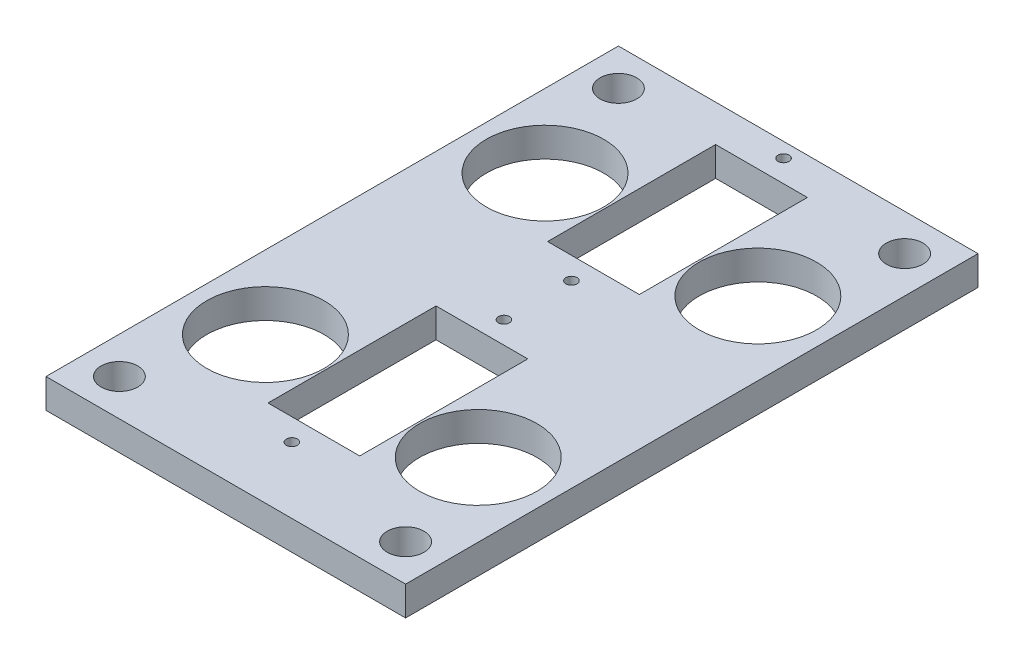
ISO-10303-21;
HEADER;
FILE_DESCRIPTION(('STEP AP214'),'2;1');
FILE_NAME('part.step','',(''),(''),'','','');
FILE_SCHEMA(('AUTOMOTIVE_DESIGN { 1 0 10303 214 1 1 1 1 }'));
ENDSEC;
DATA;
#1=APPLICATION_CONTEXT('core data for automotive mechanical design processes');
#2=APPLICATION_PROTOCOL_DEFINITION('international standard','automotive_design',2000,#1);
#3=PRODUCT_CONTEXT('',#1,'mechanical');
#4=PRODUCT('Part','Part','',(#3));
#5=PRODUCT_RELATED_PRODUCT_CATEGORY('part','',(#4));
#6=PRODUCT_DEFINITION_FORMATION('','',#4);
#7=PRODUCT_DEFINITION_CONTEXT('part definition',#1,'design');
#8=PRODUCT_DEFINITION('design','',#6,#7);
#9=PRODUCT_DEFINITION_SHAPE('','',#8);
#10=(LENGTH_UNIT() NAMED_UNIT(*) SI_UNIT(.MILLI.,.METRE.));
#11=(NAMED_UNIT(*) PLANE_ANGLE_UNIT() SI_UNIT($,.RADIAN.));
#12=(NAMED_UNIT(*) SI_UNIT($,.STERADIAN.) SOLID_ANGLE_UNIT());
#13=UNCERTAINTY_MEASURE_WITH_UNIT(LENGTH_MEASURE(1.E-05),#10,'distance_accuracy_value','');
#14=(GEOMETRIC_REPRESENTATION_CONTEXT(3) GLOBAL_UNCERTAINTY_ASSIGNED_CONTEXT((#13)) GLOBAL_UNIT_ASSIGNED_CONTEXT((#10,
#11,#12)) REPRESENTATION_CONTEXT('',''));
#15=CARTESIAN_POINT('',(0.,0.,0.));
#16=DIRECTION('',(0.,0.,1.));
#17=DIRECTION('',(1.,0.,0.));
#18=AXIS2_PLACEMENT_3D('',#15,#16,#17);
#19=CARTESIAN_POINT('',(0.,4.,0.));
#20=DIRECTION('',(0.,1.,0.));
#21=DIRECTION('',(0.,0.,1.));
#22=AXIS2_PLACEMENT_3D('',#19,#20,#21);
#23=PLANE('',#22);
#24=CARTESIAN_POINT('',(-19.5,4.,36.));
#25=DIRECTION('',(0.,1.,0.));
#26=DIRECTION('',(0.,0.,1.));
#27=AXIS2_PLACEMENT_3D('',#24,#25,#26);
#28=CIRCLE('',#27,2.5);
#29=CARTESIAN_POINT('',(-19.5,4.,38.5));
#30=VERTEX_POINT('',#29);
#31=EDGE_CURVE('E289',#30,#30,#28,.T.);
#32=ORIENTED_EDGE('',*,*,#31,.F.);
#33=EDGE_LOOP('',(#32));
#34=FACE_BOUND('',#33,.T.);
#35=CARTESIAN_POINT('',(19.5,4.,36.));
#36=DIRECTION('',(0.,1.,0.));
#37=DIRECTION('',(0.,0.,1.));
#38=AXIS2_PLACEMENT_3D('',#35,#36,#37);
#39=CIRCLE('',#38,2.5);
#40=CARTESIAN_POINT('',(19.5,4.,38.5));
#41=VERTEX_POINT('',#40);
#42=EDGE_CURVE('E158',#41,#41,#39,.T.);
#43=ORIENTED_EDGE('',*,*,#42,.F.);
#44=EDGE_LOOP('',(#43));
#45=FACE_BOUND('',#44,.T.);
#46=CARTESIAN_POINT('',(0.,4.,-35.));
#47=DIRECTION('',(0.,1.,0.));
#48=DIRECTION('',(0.,0.,1.));
#49=AXIS2_PLACEMENT_3D('',#46,#47,#48);
#50=CIRCLE('',#49,0.75);
#51=CARTESIAN_POINT('',(0.,4.,-34.25));
#52=VERTEX_POINT('',#51);
#53=EDGE_CURVE('E168',#52,#52,#50,.T.);
#54=ORIENTED_EDGE('',*,*,#53,.F.);
#55=EDGE_LOOP('',(#54));
#56=FACE_BOUND('',#55,.T.);
#57=CARTESIAN_POINT('',(0.,4.,-6.09999999999998));
#58=DIRECTION('',(0.,1.,0.));
#59=DIRECTION('',(0.,0.,1.));
#60=AXIS2_PLACEMENT_3D('',#57,#58,#59);
#61=CIRCLE('',#60,0.75);
#62=CARTESIAN_POINT('',(0.,4.,-5.34999999999998));
#63=VERTEX_POINT('',#62);
#64=EDGE_CURVE('E174',#63,#63,#61,.T.);
#65=ORIENTED_EDGE('',*,*,#64,.F.);
#66=EDGE_LOOP('',(#65));
#67=FACE_BOUND('',#66,.T.);
#68=CARTESIAN_POINT('',(0.,4.,3.10000000000001));
#69=DIRECTION('',(0.,1.,0.));
#70=DIRECTION('',(0.,0.,1.));
#71=AXIS2_PLACEMENT_3D('',#68,#69,#70);
#72=CIRCLE('',#71,0.75);
#73=CARTESIAN_POINT('',(0.,4.,3.85000000000001));
#74=VERTEX_POINT('',#73);
#75=EDGE_CURVE('E180',#74,#74,#72,.T.);
#76=ORIENTED_EDGE('',*,*,#75,.F.);
#77=EDGE_LOOP('',(#76));
#78=FACE_BOUND('',#77,.T.);
#79=CARTESIAN_POINT('',(0.,4.,32.));
#80=DIRECTION('',(0.,1.,0.));
#81=DIRECTION('',(0.,0.,1.));
#82=AXIS2_PLACEMENT_3D('',#79,#80,#81);
#83=CIRCLE('',#82,0.75);
#84=CARTESIAN_POINT('',(0.,4.,32.75));
#85=VERTEX_POINT('',#84);
#86=EDGE_CURVE('E163',#85,#85,#83,.T.);
#87=ORIENTED_EDGE('',*,*,#86,.F.);
#88=EDGE_LOOP('',(#87));
#89=FACE_BOUND('',#88,.T.);
#90=CARTESIAN_POINT('',(-19.5,4.,-32.));
#91=DIRECTION('',(0.,1.,0.));
#92=DIRECTION('',(0.,0.,1.));
#93=AXIS2_PLACEMENT_3D('',#90,#91,#92);
#94=CIRCLE('',#93,2.5);
#95=CARTESIAN_POINT('',(-19.5,4.,-29.5));
#96=VERTEX_POINT('',#95);
#97=EDGE_CURVE('E194',#96,#96,#94,.T.);
#98=ORIENTED_EDGE('',*,*,#97,.F.);
#99=EDGE_LOOP('',(#98));
#100=FACE_BOUND('',#99,.T.);
#101=CARTESIAN_POINT('',(-14.5,4.,-17.));
#102=DIRECTION('',(0.,1.,0.));
#103=DIRECTION('',(0.,0.,1.));
#104=AXIS2_PLACEMENT_3D('',#101,#102,#103);
#105=CIRCLE('',#104,8.);
#106=CARTESIAN_POINT('',(-14.5,4.,-8.99999999999998));
#107=VERTEX_POINT('',#106);
#108=EDGE_CURVE('E206',#107,#107,#105,.T.);
#109=ORIENTED_EDGE('',*,*,#108,.F.);
#110=EDGE_LOOP('',(#109));
#111=FACE_BOUND('',#110,.T.);
#112=DIRECTION('',(-1.,0.,0.));
#113=VECTOR('',#112,1.);
#114=CARTESIAN_POINT('',(-6.25,4.,6.10000000000001));
#115=LINE('',#114,#113);
#116=CARTESIAN_POINT('',(6.25,4.,6.10000000000001));
#117=VERTEX_POINT('',#116);
#118=CARTESIAN_POINT('',(-6.25,4.,6.10000000000001));
#119=VERTEX_POINT('',#118);
#120=EDGE_CURVE('E245',#117,#119,#115,.T.);
#121=ORIENTED_EDGE('',*,*,#120,.F.);
#122=DIRECTION('',(0.,0.,-1.));
#123=VECTOR('',#122,1.);
#124=CARTESIAN_POINT('',(6.25,4.,6.10000000000001));
#125=LINE('',#124,#123);
#126=CARTESIAN_POINT('',(6.25,4.,29.));
#127=VERTEX_POINT('',#126);
#128=EDGE_CURVE('E243',#127,#117,#125,.T.);
#129=ORIENTED_EDGE('',*,*,#128,.F.);
#130=DIRECTION('',(1.,0.,0.));
#131=VECTOR('',#130,1.);
#132=CARTESIAN_POINT('',(-6.25,4.,29.));
#133=LINE('',#132,#131);
#134=CARTESIAN_POINT('',(-6.25,4.,29.));
#135=VERTEX_POINT('',#134);
#136=EDGE_CURVE('E251',#135,#127,#133,.T.);
#137=ORIENTED_EDGE('',*,*,#136,.F.);
#138=DIRECTION('',(0.,0.,1.));
#139=VECTOR('',#138,1.);
#140=CARTESIAN_POINT('',(-6.25,4.,6.10000000000001));
#141=LINE('',#140,#139);
#142=EDGE_CURVE('E248',#119,#135,#141,.T.);
#143=ORIENTED_EDGE('',*,*,#142,.F.);
#144=EDGE_LOOP('',(#121,#129,#137,#143));
#145=FACE_BOUND('',#144,.T.);
#146=CARTESIAN_POINT('',(14.5,4.,21.1));
#147=DIRECTION('',(0.,1.,0.));
#148=DIRECTION('',(0.,0.,1.));
#149=AXIS2_PLACEMENT_3D('',#146,#147,#148);
#150=CIRCLE('',#149,8.);
#151=CARTESIAN_POINT('',(14.5,4.,29.1));
#152=VERTEX_POINT('',#151);
#153=EDGE_CURVE('E274',#152,#152,#150,.T.);
#154=ORIENTED_EDGE('',*,*,#153,.F.);
#155=EDGE_LOOP('',(#154));
#156=FACE_BOUND('',#155,.T.);
#157=DIRECTION('',(0.,0.,-1.));
#158=VECTOR('',#157,1.);
#159=CARTESIAN_POINT('',(24.5,4.,-37.));
#160=LINE('',#159,#158);
#161=CARTESIAN_POINT('',(24.5,4.,41.));
#162=VERTEX_POINT('',#161);
#163=CARTESIAN_POINT('',(24.5,4.,-37.));
#164=VERTEX_POINT('',#163);
#165=EDGE_CURVE('E280',#162,#164,#160,.T.);
#166=ORIENTED_EDGE('',*,*,#165,.T.);
#167=DIRECTION('',(-1.,0.,0.));
#168=VECTOR('',#167,1.);
#169=CARTESIAN_POINT('',(-24.5,4.,-37.));
#170=LINE('',#169,#168);
#171=CARTESIAN_POINT('',(-24.5,4.,-37.));
#172=VERTEX_POINT('',#171);
#173=EDGE_CURVE('E135',#164,#172,#170,.T.);
#174=ORIENTED_EDGE('',*,*,#173,.T.);
#175=DIRECTION('',(0.,0.,1.));
#176=VECTOR('',#175,1.);
#177=CARTESIAN_POINT('',(-24.5,4.,-37.));
#178=LINE('',#177,#176);
#179=CARTESIAN_POINT('',(-24.5,4.,41.));
#180=VERTEX_POINT('',#179);
#181=EDGE_CURVE('E129',#172,#180,#178,.T.);
#182=ORIENTED_EDGE('',*,*,#181,.T.);
#183=DIRECTION('',(1.,0.,0.));
#184=VECTOR('',#183,1.);
#185=CARTESIAN_POINT('',(-24.5,4.,41.));
#186=LINE('',#185,#184);
#187=EDGE_CURVE('E134',#180,#162,#186,.T.);
#188=ORIENTED_EDGE('',*,*,#187,.T.);
#189=EDGE_LOOP('',(#166,#174,#182,#188));
#190=FACE_BOUND('',#189,.T.);
#191=CARTESIAN_POINT('',(-14.5,4.,21.1));
#192=DIRECTION('',(0.,1.,0.));
#193=DIRECTION('',(0.,0.,1.));
#194=AXIS2_PLACEMENT_3D('',#191,#192,#193);
#195=CIRCLE('',#194,8.);
#196=CARTESIAN_POINT('',(-14.5,4.,29.1));
#197=VERTEX_POINT('',#196);
#198=EDGE_CURVE('E237',#197,#197,#195,.T.);
#199=ORIENTED_EDGE('',*,*,#198,.F.);
#200=EDGE_LOOP('',(#199));
#201=FACE_BOUND('',#200,.T.);
#202=DIRECTION('',(1.,0.,0.));
#203=VECTOR('',#202,1.);
#204=CARTESIAN_POINT('',(6.25,4.,-9.09999999999998));
#205=LINE('',#204,#203);
#206=CARTESIAN_POINT('',(-6.25,4.,-9.09999999999998));
#207=VERTEX_POINT('',#206);
#208=CARTESIAN_POINT('',(6.25,4.,-9.09999999999998));
#209=VERTEX_POINT('',#208);
#210=EDGE_CURVE('E213',#207,#209,#205,.T.);
#211=ORIENTED_EDGE('',*,*,#210,.F.);
#212=DIRECTION('',(0.,0.,1.));
#213=VECTOR('',#212,1.);
#214=CARTESIAN_POINT('',(-6.25000000000001,4.,-32.));
#215=LINE('',#214,#213);
#216=CARTESIAN_POINT('',(-6.25000000000001,4.,-32.));
#217=VERTEX_POINT('',#216);
#218=EDGE_CURVE('E211',#217,#207,#215,.T.);
#219=ORIENTED_EDGE('',*,*,#218,.F.);
#220=DIRECTION('',(-1.,0.,0.));
#221=VECTOR('',#220,1.);
#222=CARTESIAN_POINT('',(6.24999999999999,4.,-32.));
#223=LINE('',#222,#221);
#224=CARTESIAN_POINT('',(6.24999999999999,4.,-32.));
#225=VERTEX_POINT('',#224);
#226=EDGE_CURVE('E218',#225,#217,#223,.T.);
#227=ORIENTED_EDGE('',*,*,#226,.F.);
#228=DIRECTION('',(0.,0.,-1.));
#229=VECTOR('',#228,1.);
#230=CARTESIAN_POINT('',(6.24999999999999,4.,-32.));
#231=LINE('',#230,#229);
#232=EDGE_CURVE('E216',#209,#225,#231,.T.);
#233=ORIENTED_EDGE('',*,*,#232,.F.);
#234=EDGE_LOOP('',(#211,#219,#227,#233));
#235=FACE_BOUND('',#234,.T.);
#236=CARTESIAN_POINT('',(14.5,4.,-17.));
#237=DIRECTION('',(0.,1.,0.));
#238=DIRECTION('',(0.,0.,1.));
#239=AXIS2_PLACEMENT_3D('',#236,#237,#238);
#240=CIRCLE('',#239,8.);
#241=CARTESIAN_POINT('',(14.5,4.,-8.99999999999998));
#242=VERTEX_POINT('',#241);
#243=EDGE_CURVE('E200',#242,#242,#240,.T.);
#244=ORIENTED_EDGE('',*,*,#243,.F.);
#245=EDGE_LOOP('',(#244));
#246=FACE_BOUND('',#245,.T.);
#247=CARTESIAN_POINT('',(19.5,4.,-32.));
#248=DIRECTION('',(0.,1.,0.));
#249=DIRECTION('',(0.,0.,1.));
#250=AXIS2_PLACEMENT_3D('',#247,#248,#249);
#251=CIRCLE('',#250,2.5);
#252=CARTESIAN_POINT('',(19.5,4.,-29.5));
#253=VERTEX_POINT('',#252);
#254=EDGE_CURVE('E188',#253,#253,#251,.T.);
#255=ORIENTED_EDGE('',*,*,#254,.F.);
#256=EDGE_LOOP('',(#255));
#257=FACE_BOUND('',#256,.T.);
#258=ADVANCED_FACE('F36',(#34,#45,#56,#67,#78,#89,#100,#111,#145,#156,#190,#201,#235,#246,#257),
#23,.T.);
#259=CARTESIAN_POINT('',(0.,0.,0.));
#260=DIRECTION('',(0.,1.,0.));
#261=DIRECTION('',(0.,0.,1.));
#262=AXIS2_PLACEMENT_3D('',#259,#260,#261);
#263=PLANE('',#262);
#264=CARTESIAN_POINT('',(-19.5,0.,36.));
#265=DIRECTION('',(0.,1.,0.));
#266=DIRECTION('',(0.,0.,1.));
#267=AXIS2_PLACEMENT_3D('',#264,#265,#266);
#268=CIRCLE('',#267,2.5);
#269=CARTESIAN_POINT('',(-19.5,0.,38.5));
#270=VERTEX_POINT('',#269);
#271=EDGE_CURVE('E40',#270,#270,#268,.T.);
#272=ORIENTED_EDGE('',*,*,#271,.T.);
#273=EDGE_LOOP('',(#272));
#274=FACE_BOUND('',#273,.T.);
#275=CARTESIAN_POINT('',(19.5,0.,36.));
#276=DIRECTION('',(0.,1.,0.));
#277=DIRECTION('',(0.,0.,1.));
#278=AXIS2_PLACEMENT_3D('',#275,#276,#277);
#279=CIRCLE('',#278,2.5);
#280=CARTESIAN_POINT('',(19.5,0.,38.5));
#281=VERTEX_POINT('',#280);
#282=EDGE_CURVE('E155',#281,#281,#279,.T.);
#283=ORIENTED_EDGE('',*,*,#282,.T.);
#284=EDGE_LOOP('',(#283));
#285=FACE_BOUND('',#284,.T.);
#286=CARTESIAN_POINT('',(0.,0.,-35.));
#287=DIRECTION('',(0.,1.,0.));
#288=DIRECTION('',(0.,0.,1.));
#289=AXIS2_PLACEMENT_3D('',#286,#287,#288);
#290=CIRCLE('',#289,0.75);
#291=CARTESIAN_POINT('',(0.,0.,-34.25));
#292=VERTEX_POINT('',#291);
#293=EDGE_CURVE('E164',#292,#292,#290,.T.);
#294=ORIENTED_EDGE('',*,*,#293,.T.);
#295=EDGE_LOOP('',(#294));
#296=FACE_BOUND('',#295,.T.);
#297=CARTESIAN_POINT('',(0.,0.,-6.09999999999998));
#298=DIRECTION('',(0.,1.,0.));
#299=DIRECTION('',(0.,0.,1.));
#300=AXIS2_PLACEMENT_3D('',#297,#298,#299);
#301=CIRCLE('',#300,0.75);
#302=CARTESIAN_POINT('',(0.,0.,-5.34999999999998));
#303=VERTEX_POINT('',#302);
#304=EDGE_CURVE('E171',#303,#303,#301,.T.);
#305=ORIENTED_EDGE('',*,*,#304,.T.);
#306=EDGE_LOOP('',(#305));
#307=FACE_BOUND('',#306,.T.);
#308=CARTESIAN_POINT('',(0.,0.,3.10000000000001));
#309=DIRECTION('',(0.,1.,0.));
#310=DIRECTION('',(0.,0.,1.));
#311=AXIS2_PLACEMENT_3D('',#308,#309,#310);
#312=CIRCLE('',#311,0.75);
#313=CARTESIAN_POINT('',(0.,0.,3.85000000000001));
#314=VERTEX_POINT('',#313);
#315=EDGE_CURVE('E177',#314,#314,#312,.T.);
#316=ORIENTED_EDGE('',*,*,#315,.T.);
#317=EDGE_LOOP('',(#316));
#318=FACE_BOUND('',#317,.T.);
#319=CARTESIAN_POINT('',(0.,0.,32.));
#320=DIRECTION('',(0.,1.,0.));
#321=DIRECTION('',(0.,0.,1.));
#322=AXIS2_PLACEMENT_3D('',#319,#320,#321);
#323=CIRCLE('',#322,0.75);
#324=CARTESIAN_POINT('',(0.,0.,32.75));
#325=VERTEX_POINT('',#324);
#326=EDGE_CURVE('E183',#325,#325,#323,.T.);
#327=ORIENTED_EDGE('',*,*,#326,.T.);
#328=EDGE_LOOP('',(#327));
#329=FACE_BOUND('',#328,.T.);
#330=CARTESIAN_POINT('',(-14.5,0.,21.1));
#331=DIRECTION('',(0.,1.,0.));
#332=DIRECTION('',(0.,0.,1.));
#333=AXIS2_PLACEMENT_3D('',#330,#331,#332);
#334=CIRCLE('',#333,8.);
#335=CARTESIAN_POINT('',(-14.5,0.,29.1));
#336=VERTEX_POINT('',#335);
#337=EDGE_CURVE('E236',#336,#336,#334,.T.);
#338=ORIENTED_EDGE('',*,*,#337,.T.);
#339=EDGE_LOOP('',(#338));
#340=FACE_BOUND('',#339,.T.);
#341=DIRECTION('',(0.,0.,-1.));
#342=VECTOR('',#341,1.);
#343=CARTESIAN_POINT('',(6.25,0.,6.10000000000001));
#344=LINE('',#343,#342);
#345=CARTESIAN_POINT('',(6.25,0.,29.));
#346=VERTEX_POINT('',#345);
#347=CARTESIAN_POINT('',(6.25,0.,6.10000000000001));
#348=VERTEX_POINT('',#347);
#349=EDGE_CURVE('E240',#346,#348,#344,.T.);
#350=ORIENTED_EDGE('',*,*,#349,.T.);
#351=DIRECTION('',(-1.,0.,0.));
#352=VECTOR('',#351,1.);
#353=CARTESIAN_POINT('',(-6.25,0.,6.10000000000001));
#354=LINE('',#353,#352);
#355=CARTESIAN_POINT('',(-6.25,0.,6.10000000000001));
#356=VERTEX_POINT('',#355);
#357=EDGE_CURVE('E256',#348,#356,#354,.T.);
#358=ORIENTED_EDGE('',*,*,#357,.T.);
#359=DIRECTION('',(0.,0.,1.));
#360=VECTOR('',#359,1.);
#361=CARTESIAN_POINT('',(-6.25,0.,6.10000000000001));
#362=LINE('',#361,#360);
#363=CARTESIAN_POINT('',(-6.25,0.,29.));
#364=VERTEX_POINT('',#363);
#365=EDGE_CURVE('E259',#356,#364,#362,.T.);
#366=ORIENTED_EDGE('',*,*,#365,.T.);
#367=DIRECTION('',(1.,0.,0.));
#368=VECTOR('',#367,1.);
#369=CARTESIAN_POINT('',(-6.25,0.,29.));
#370=LINE('',#369,#368);
#371=EDGE_CURVE('E246',#364,#346,#370,.T.);
#372=ORIENTED_EDGE('',*,*,#371,.T.);
#373=EDGE_LOOP('',(#350,#358,#366,#372));
#374=FACE_BOUND('',#373,.T.);
#375=DIRECTION('',(0.,0.,-1.));
#376=VECTOR('',#375,1.);
#377=CARTESIAN_POINT('',(24.5,0.,-37.));
#378=LINE('',#377,#376);
#379=CARTESIAN_POINT('',(24.5,0.,41.));
#380=VERTEX_POINT('',#379);
#381=CARTESIAN_POINT('',(24.5,0.,-37.));
#382=VERTEX_POINT('',#381);
#383=EDGE_CURVE('E277',#380,#382,#378,.T.);
#384=ORIENTED_EDGE('',*,*,#383,.F.);
#385=DIRECTION('',(-1.,0.,0.));
#386=VECTOR('',#385,1.);
#387=CARTESIAN_POINT('',(-24.5,0.,41.));
#388=LINE('',#387,#386);
#389=CARTESIAN_POINT('',(-24.5,0.,41.));
#390=VERTEX_POINT('',#389);
#391=EDGE_CURVE('E160',#380,#390,#388,.T.);
#392=ORIENTED_EDGE('',*,*,#391,.T.);
#393=DIRECTION('',(0.,0.,1.));
#394=VECTOR('',#393,1.);
#395=CARTESIAN_POINT('',(-24.5,0.,-37.));
#396=LINE('',#395,#394);
#397=CARTESIAN_POINT('',(-24.5,0.,-37.));
#398=VERTEX_POINT('',#397);
#399=EDGE_CURVE('E144',#398,#390,#396,.T.);
#400=ORIENTED_EDGE('',*,*,#399,.F.);
#401=DIRECTION('',(-1.,0.,0.));
#402=VECTOR('',#401,1.);
#403=CARTESIAN_POINT('',(-24.5,0.,-37.));
#404=LINE('',#403,#402);
#405=EDGE_CURVE('E285',#382,#398,#404,.T.);
#406=ORIENTED_EDGE('',*,*,#405,.F.);
#407=EDGE_LOOP('',(#384,#392,#400,#406));
#408=FACE_BOUND('',#407,.T.);
#409=CARTESIAN_POINT('',(14.5,0.,21.1));
#410=DIRECTION('',(0.,1.,0.));
#411=DIRECTION('',(0.,0.,1.));
#412=AXIS2_PLACEMENT_3D('',#409,#410,#411);
#413=CIRCLE('',#412,8.);
#414=CARTESIAN_POINT('',(14.5,0.,29.1));
#415=VERTEX_POINT('',#414);
#416=EDGE_CURVE('E273',#415,#415,#413,.T.);
#417=ORIENTED_EDGE('',*,*,#416,.T.);
#418=EDGE_LOOP('',(#417));
#419=FACE_BOUND('',#418,.T.);
#420=DIRECTION('',(0.,0.,1.));
#421=VECTOR('',#420,1.);
#422=CARTESIAN_POINT('',(-6.25000000000001,0.,-32.));
#423=LINE('',#422,#421);
#424=CARTESIAN_POINT('',(-6.25000000000001,0.,-32.));
#425=VERTEX_POINT('',#424);
#426=CARTESIAN_POINT('',(-6.25,0.,-9.09999999999998));
#427=VERTEX_POINT('',#426);
#428=EDGE_CURVE('E61',#425,#427,#423,.T.);
#429=ORIENTED_EDGE('',*,*,#428,.T.);
#430=DIRECTION('',(1.,0.,0.));
#431=VECTOR('',#430,1.);
#432=CARTESIAN_POINT('',(6.25,0.,-9.09999999999998));
#433=LINE('',#432,#431);
#434=CARTESIAN_POINT('',(6.25,0.,-9.09999999999998));
#435=VERTEX_POINT('',#434);
#436=EDGE_CURVE('E222',#427,#435,#433,.T.);
#437=ORIENTED_EDGE('',*,*,#436,.T.);
#438=DIRECTION('',(0.,0.,-1.));
#439=VECTOR('',#438,1.);
#440=CARTESIAN_POINT('',(6.24999999999999,0.,-32.));
#441=LINE('',#440,#439);
#442=CARTESIAN_POINT('',(6.24999999999999,0.,-32.));
#443=VERTEX_POINT('',#442);
#444=EDGE_CURVE('E225',#435,#443,#441,.T.);
#445=ORIENTED_EDGE('',*,*,#444,.T.);
#446=DIRECTION('',(-1.,0.,0.));
#447=VECTOR('',#446,1.);
#448=CARTESIAN_POINT('',(6.24999999999999,0.,-32.));
#449=LINE('',#448,#447);
#450=EDGE_CURVE('E214',#443,#425,#449,.T.);
#451=ORIENTED_EDGE('',*,*,#450,.T.);
#452=EDGE_LOOP('',(#429,#437,#445,#451));
#453=FACE_BOUND('',#452,.T.);
#454=CARTESIAN_POINT('',(-14.5,0.,-17.));
#455=DIRECTION('',(0.,1.,0.));
#456=DIRECTION('',(0.,0.,1.));
#457=AXIS2_PLACEMENT_3D('',#454,#455,#456);
#458=CIRCLE('',#457,8.);
#459=CARTESIAN_POINT('',(-14.5,0.,-8.99999999999998));
#460=VERTEX_POINT('',#459);
#461=EDGE_CURVE('E203',#460,#460,#458,.T.);
#462=ORIENTED_EDGE('',*,*,#461,.T.);
#463=EDGE_LOOP('',(#462));
#464=FACE_BOUND('',#463,.T.);
#465=CARTESIAN_POINT('',(14.5,0.,-17.));
#466=DIRECTION('',(0.,1.,0.));
#467=DIRECTION('',(0.,0.,1.));
#468=AXIS2_PLACEMENT_3D('',#465,#466,#467);
#469=CIRCLE('',#468,8.);
#470=CARTESIAN_POINT('',(14.5,0.,-8.99999999999998));
#471=VERTEX_POINT('',#470);
#472=EDGE_CURVE('E197',#471,#471,#469,.T.);
#473=ORIENTED_EDGE('',*,*,#472,.T.);
#474=EDGE_LOOP('',(#473));
#475=FACE_BOUND('',#474,.T.);
#476=CARTESIAN_POINT('',(-19.5,0.,-32.));
#477=DIRECTION('',(0.,1.,0.));
#478=DIRECTION('',(0.,0.,1.));
#479=AXIS2_PLACEMENT_3D('',#476,#477,#478);
#480=CIRCLE('',#479,2.5);
#481=CARTESIAN_POINT('',(-19.5,0.,-29.5));
#482=VERTEX_POINT('',#481);
#483=EDGE_CURVE('E191',#482,#482,#480,.T.);
#484=ORIENTED_EDGE('',*,*,#483,.T.);
#485=EDGE_LOOP('',(#484));
#486=FACE_BOUND('',#485,.T.);
#487=CARTESIAN_POINT('',(19.5,0.,-32.));
#488=DIRECTION('',(0.,1.,0.));
#489=DIRECTION('',(0.,0.,1.));
#490=AXIS2_PLACEMENT_3D('',#487,#488,#489);
#491=CIRCLE('',#490,2.5);
#492=CARTESIAN_POINT('',(19.5,0.,-29.5));
#493=VERTEX_POINT('',#492);
#494=EDGE_CURVE('E167',#493,#493,#491,.T.);
#495=ORIENTED_EDGE('',*,*,#494,.T.);
#496=EDGE_LOOP('',(#495));
#497=FACE_BOUND('',#496,.T.);
#498=ADVANCED_FACE('F303',(#274,#285,#296,#307,#318,#329,#340,#374,#408,#419,#453,#464,#475,
#486,#497),#263,.F.);
#499=CARTESIAN_POINT('',(24.5,4.,-37.));
#500=DIRECTION('',(-1.,0.,0.));
#501=DIRECTION('',(0.,0.,1.));
#502=AXIS2_PLACEMENT_3D('',#499,#500,#501);
#503=PLANE('',#502);
#504=ORIENTED_EDGE('',*,*,#383,.T.);
#505=DIRECTION('',(0.,-1.,0.));
#506=VECTOR('',#505,1.);
#507=CARTESIAN_POINT('',(24.5,4.,-37.));
#508=LINE('',#507,#506);
#509=EDGE_CURVE('E11',#164,#382,#508,.T.);
#510=ORIENTED_EDGE('',*,*,#509,.F.);
#511=ORIENTED_EDGE('',*,*,#165,.F.);
#512=DIRECTION('',(0.,1.,0.));
#513=VECTOR('',#512,1.);
#514=CARTESIAN_POINT('',(24.5,-49.254441424099,41.));
#515=LINE('',#514,#513);
#516=EDGE_CURVE('E148',#380,#162,#515,.T.);
#517=ORIENTED_EDGE('',*,*,#516,.F.);
#518=EDGE_LOOP('',(#504,#510,#511,#517));
#519=FACE_BOUND('',#518,.T.);
#520=ADVANCED_FACE('F38',(#519),#503,.F.);
#521=CARTESIAN_POINT('',(-24.5,4.,-37.));
#522=DIRECTION('',(0.,0.,1.));
#523=DIRECTION('',(1.,0.,0.));
#524=AXIS2_PLACEMENT_3D('',#521,#522,#523);
#525=PLANE('',#524);
#526=ORIENTED_EDGE('',*,*,#405,.T.);
#527=DIRECTION('',(0.,-1.,0.));
#528=VECTOR('',#527,1.);
#529=CARTESIAN_POINT('',(-24.5,4.,-37.));
#530=LINE('',#529,#528);
#531=EDGE_CURVE('E45',#172,#398,#530,.T.);
#532=ORIENTED_EDGE('',*,*,#531,.F.);
#533=ORIENTED_EDGE('',*,*,#173,.F.);
#534=ORIENTED_EDGE('',*,*,#509,.T.);
#535=EDGE_LOOP('',(#526,#532,#533,#534));
#536=FACE_BOUND('',#535,.T.);
#537=ADVANCED_FACE('F403',(#536),#525,.F.);
#538=CARTESIAN_POINT('',(-24.5,4.,-37.));
#539=DIRECTION('',(1.,0.,0.));
#540=DIRECTION('',(0.,0.,-1.));
#541=AXIS2_PLACEMENT_3D('',#538,#539,#540);
#542=PLANE('',#541);
#543=ORIENTED_EDGE('',*,*,#399,.T.);
#544=DIRECTION('',(0.,1.,0.));
#545=VECTOR('',#544,1.);
#546=CARTESIAN_POINT('',(-24.5,-49.254441424099,41.));
#547=LINE('',#546,#545);
#548=EDGE_CURVE('E141',#390,#180,#547,.T.);
#549=ORIENTED_EDGE('',*,*,#548,.T.);
#550=ORIENTED_EDGE('',*,*,#181,.F.);
#551=ORIENTED_EDGE('',*,*,#531,.T.);
#552=EDGE_LOOP('',(#543,#549,#550,#551));
#553=FACE_BOUND('',#552,.T.);
#554=ADVANCED_FACE('F142',(#553),#542,.F.);
#555=CARTESIAN_POINT('',(14.5,4.,21.1));
#556=DIRECTION('',(0.,-1.,0.));
#557=DIRECTION('',(0.,0.,-1.));
#558=AXIS2_PLACEMENT_3D('',#555,#556,#557);
#559=CYLINDRICAL_SURFACE('',#558,8.);
#560=ORIENTED_EDGE('',*,*,#153,.T.);
#561=EDGE_LOOP('',(#560));
#562=FACE_BOUND('',#561,.T.);
#563=ORIENTED_EDGE('',*,*,#416,.F.);
#564=EDGE_LOOP('',(#563));
#565=FACE_BOUND('',#564,.T.);
#566=ADVANCED_FACE('F324',(#562,#565),#559,.F.);
#567=CARTESIAN_POINT('',(6.25,4.,6.10000000000001));
#568=DIRECTION('',(-1.,0.,0.));
#569=DIRECTION('',(0.,0.,1.));
#570=AXIS2_PLACEMENT_3D('',#567,#568,#569);
#571=PLANE('',#570);
#572=ORIENTED_EDGE('',*,*,#349,.F.);
#573=DIRECTION('',(0.,-1.,0.));
#574=VECTOR('',#573,1.);
#575=CARTESIAN_POINT('',(6.25,4.,29.));
#576=LINE('',#575,#574);
#577=EDGE_CURVE('E253',#127,#346,#576,.T.);
#578=ORIENTED_EDGE('',*,*,#577,.F.);
#579=ORIENTED_EDGE('',*,*,#128,.T.);
#580=DIRECTION('',(0.,-1.,0.));
#581=VECTOR('',#580,1.);
#582=CARTESIAN_POINT('',(6.25,4.,6.10000000000001));
#583=LINE('',#582,#581);
#584=EDGE_CURVE('E270',#117,#348,#583,.T.);
#585=ORIENTED_EDGE('',*,*,#584,.T.);
#586=EDGE_LOOP('',(#572,#578,#579,#585));
#587=FACE_BOUND('',#586,.T.);
#588=ADVANCED_FACE('F327',(#587),#571,.T.);
#589=CARTESIAN_POINT('',(-6.25,4.,6.10000000000001));
#590=DIRECTION('',(0.,0.,1.));
#591=DIRECTION('',(1.,0.,0.));
#592=AXIS2_PLACEMENT_3D('',#589,#590,#591);
#593=PLANE('',#592);
#594=ORIENTED_EDGE('',*,*,#357,.F.);
#595=ORIENTED_EDGE('',*,*,#584,.F.);
#596=ORIENTED_EDGE('',*,*,#120,.T.);
#597=DIRECTION('',(0.,-1.,0.));
#598=VECTOR('',#597,1.);
#599=CARTESIAN_POINT('',(-6.25,4.,6.10000000000001));
#600=LINE('',#599,#598);
#601=EDGE_CURVE('E268',#119,#356,#600,.T.);
#602=ORIENTED_EDGE('',*,*,#601,.T.);
#603=EDGE_LOOP('',(#594,#595,#596,#602));
#604=FACE_BOUND('',#603,.T.);
#605=ADVANCED_FACE('F394',(#604),#593,.T.);
#606=CARTESIAN_POINT('',(-6.25,4.,6.10000000000001));
#607=DIRECTION('',(1.,0.,0.));
#608=DIRECTION('',(0.,0.,-1.));
#609=AXIS2_PLACEMENT_3D('',#606,#607,#608);
#610=PLANE('',#609);
#611=ORIENTED_EDGE('',*,*,#365,.F.);
#612=ORIENTED_EDGE('',*,*,#601,.F.);
#613=ORIENTED_EDGE('',*,*,#142,.T.);
#614=DIRECTION('',(0.,-1.,0.));
#615=VECTOR('',#614,1.);
#616=CARTESIAN_POINT('',(-6.25,4.,29.));
#617=LINE('',#616,#615);
#618=EDGE_CURVE('E266',#135,#364,#617,.T.);
#619=ORIENTED_EDGE('',*,*,#618,.T.);
#620=EDGE_LOOP('',(#611,#612,#613,#619));
#621=FACE_BOUND('',#620,.T.);
#622=ADVANCED_FACE('F390',(#621),#610,.T.);
#623=CARTESIAN_POINT('',(-6.25,4.,29.));
#624=DIRECTION('',(0.,0.,-1.));
#625=DIRECTION('',(-1.,0.,0.));
#626=AXIS2_PLACEMENT_3D('',#623,#624,#625);
#627=PLANE('',#626);
#628=ORIENTED_EDGE('',*,*,#371,.F.);
#629=ORIENTED_EDGE('',*,*,#618,.F.);
#630=ORIENTED_EDGE('',*,*,#136,.T.);
#631=ORIENTED_EDGE('',*,*,#577,.T.);
#632=EDGE_LOOP('',(#628,#629,#630,#631));
#633=FACE_BOUND('',#632,.T.);
#634=ADVANCED_FACE('F386',(#633),#627,.T.);
#635=CARTESIAN_POINT('',(-14.5,4.,21.1));
#636=DIRECTION('',(0.,-1.,0.));
#637=DIRECTION('',(0.,0.,-1.));
#638=AXIS2_PLACEMENT_3D('',#635,#636,#637);
#639=CYLINDRICAL_SURFACE('',#638,8.);
#640=ORIENTED_EDGE('',*,*,#198,.T.);
#641=EDGE_LOOP('',(#640));
#642=FACE_BOUND('',#641,.T.);
#643=ORIENTED_EDGE('',*,*,#337,.F.);
#644=EDGE_LOOP('',(#643));
#645=FACE_BOUND('',#644,.T.);
#646=ADVANCED_FACE('F383',(#642,#645),#639,.F.);
#647=CARTESIAN_POINT('',(-6.25000000000001,4.,-32.));
#648=DIRECTION('',(1.,0.,0.));
#649=DIRECTION('',(0.,0.,-1.));
#650=AXIS2_PLACEMENT_3D('',#647,#648,#649);
#651=PLANE('',#650);
#652=ORIENTED_EDGE('',*,*,#428,.F.);
#653=DIRECTION('',(0.,-1.,0.));
#654=VECTOR('',#653,1.);
#655=CARTESIAN_POINT('',(-6.25000000000001,4.,-32.));
#656=LINE('',#655,#654);
#657=EDGE_CURVE('E220',#217,#425,#656,.T.);
#658=ORIENTED_EDGE('',*,*,#657,.F.);
#659=ORIENTED_EDGE('',*,*,#218,.T.);
#660=DIRECTION('',(0.,-1.,0.));
#661=VECTOR('',#660,1.);
#662=CARTESIAN_POINT('',(-6.25,4.,-9.09999999999998));
#663=LINE('',#662,#661);
#664=EDGE_CURVE('E234',#207,#427,#663,.T.);
#665=ORIENTED_EDGE('',*,*,#664,.T.);
#666=EDGE_LOOP('',(#652,#658,#659,#665));
#667=FACE_BOUND('',#666,.T.);
#668=ADVANCED_FACE('F379',(#667),#651,.T.);
#669=CARTESIAN_POINT('',(6.25,4.,-9.09999999999998));
#670=DIRECTION('',(0.,0.,-1.));
#671=DIRECTION('',(-1.,0.,0.));
#672=AXIS2_PLACEMENT_3D('',#669,#670,#671);
#673=PLANE('',#672);
#674=ORIENTED_EDGE('',*,*,#436,.F.);
#675=ORIENTED_EDGE('',*,*,#664,.F.);
#676=ORIENTED_EDGE('',*,*,#210,.T.);
#677=DIRECTION('',(0.,-1.,0.));
#678=VECTOR('',#677,1.);
#679=CARTESIAN_POINT('',(6.25,4.,-9.09999999999998));
#680=LINE('',#679,#678);
#681=EDGE_CURVE('E232',#209,#435,#680,.T.);
#682=ORIENTED_EDGE('',*,*,#681,.T.);
#683=EDGE_LOOP('',(#674,#675,#676,#682));
#684=FACE_BOUND('',#683,.T.);
#685=ADVANCED_FACE('F375',(#684),#673,.T.);
#686=CARTESIAN_POINT('',(6.24999999999999,4.,-32.));
#687=DIRECTION('',(-1.,0.,0.));
#688=DIRECTION('',(0.,0.,1.));
#689=AXIS2_PLACEMENT_3D('',#686,#687,#688);
#690=PLANE('',#689);
#691=ORIENTED_EDGE('',*,*,#444,.F.);
#692=ORIENTED_EDGE('',*,*,#681,.F.);
#693=ORIENTED_EDGE('',*,*,#232,.T.);
#694=DIRECTION('',(0.,-1.,0.));
#695=VECTOR('',#694,1.);
#696=CARTESIAN_POINT('',(6.24999999999999,4.,-32.));
#697=LINE('',#696,#695);
#698=EDGE_CURVE('E53',#225,#443,#697,.T.);
#699=ORIENTED_EDGE('',*,*,#698,.T.);
#700=EDGE_LOOP('',(#691,#692,#693,#699));
#701=FACE_BOUND('',#700,.T.);
#702=ADVANCED_FACE('F372',(#701),#690,.T.);
#703=CARTESIAN_POINT('',(6.24999999999999,4.,-32.));
#704=DIRECTION('',(0.,0.,1.));
#705=DIRECTION('',(1.,0.,0.));
#706=AXIS2_PLACEMENT_3D('',#703,#704,#705);
#707=PLANE('',#706);
#708=ORIENTED_EDGE('',*,*,#450,.F.);
#709=ORIENTED_EDGE('',*,*,#698,.F.);
#710=ORIENTED_EDGE('',*,*,#226,.T.);
#711=ORIENTED_EDGE('',*,*,#657,.T.);
#712=EDGE_LOOP('',(#708,#709,#710,#711));
#713=FACE_BOUND('',#712,.T.);
#714=ADVANCED_FACE('F368',(#713),#707,.T.);
#715=CARTESIAN_POINT('',(-14.5,4.,-17.));
#716=DIRECTION('',(0.,-1.,0.));
#717=DIRECTION('',(0.,0.,-1.));
#718=AXIS2_PLACEMENT_3D('',#715,#716,#717);
#719=CYLINDRICAL_SURFACE('',#718,8.);
#720=ORIENTED_EDGE('',*,*,#108,.T.);
#721=EDGE_LOOP('',(#720));
#722=FACE_BOUND('',#721,.T.);
#723=ORIENTED_EDGE('',*,*,#461,.F.);
#724=EDGE_LOOP('',(#723));
#725=FACE_BOUND('',#724,.T.);
#726=ADVANCED_FACE('F364',(#722,#725),#719,.F.);
#727=CARTESIAN_POINT('',(14.5,4.,-17.));
#728=DIRECTION('',(0.,-1.,0.));
#729=DIRECTION('',(0.,0.,-1.));
#730=AXIS2_PLACEMENT_3D('',#727,#728,#729);
#731=CYLINDRICAL_SURFACE('',#730,8.);
#732=ORIENTED_EDGE('',*,*,#243,.T.);
#733=EDGE_LOOP('',(#732));
#734=FACE_BOUND('',#733,.T.);
#735=ORIENTED_EDGE('',*,*,#472,.F.);
#736=EDGE_LOOP('',(#735));
#737=FACE_BOUND('',#736,.T.);
#738=ADVANCED_FACE('F357',(#734,#737),#731,.F.);
#739=CARTESIAN_POINT('',(-19.5,4.,-32.));
#740=DIRECTION('',(0.,-1.,0.));
#741=DIRECTION('',(0.,0.,-1.));
#742=AXIS2_PLACEMENT_3D('',#739,#740,#741);
#743=CYLINDRICAL_SURFACE('',#742,2.5);
#744=ORIENTED_EDGE('',*,*,#97,.T.);
#745=EDGE_LOOP('',(#744));
#746=FACE_BOUND('',#745,.T.);
#747=ORIENTED_EDGE('',*,*,#483,.F.);
#748=EDGE_LOOP('',(#747));
#749=FACE_BOUND('',#748,.T.);
#750=ADVANCED_FACE('F347',(#746,#749),#743,.F.);
#751=CARTESIAN_POINT('',(19.5,4.,-32.));
#752=DIRECTION('',(0.,-1.,0.));
#753=DIRECTION('',(0.,0.,-1.));
#754=AXIS2_PLACEMENT_3D('',#751,#752,#753);
#755=CYLINDRICAL_SURFACE('',#754,2.5);
#756=ORIENTED_EDGE('',*,*,#254,.T.);
#757=EDGE_LOOP('',(#756));
#758=FACE_BOUND('',#757,.T.);
#759=ORIENTED_EDGE('',*,*,#494,.F.);
#760=EDGE_LOOP('',(#759));
#761=FACE_BOUND('',#760,.T.);
#762=ADVANCED_FACE('F344',(#758,#761),#755,.F.);
#763=CARTESIAN_POINT('',(0.,0.,32.));
#764=DIRECTION('',(0.,1.,0.));
#765=DIRECTION('',(0.,0.,1.));
#766=AXIS2_PLACEMENT_3D('',#763,#764,#765);
#767=CYLINDRICAL_SURFACE('',#766,0.75);
#768=ORIENTED_EDGE('',*,*,#326,.F.);
#769=EDGE_LOOP('',(#768));
#770=FACE_BOUND('',#769,.T.);
#771=ORIENTED_EDGE('',*,*,#86,.T.);
#772=EDGE_LOOP('',(#771));
#773=FACE_BOUND('',#772,.T.);
#774=ADVANCED_FACE('F346',(#770,#773),#767,.F.);
#775=CARTESIAN_POINT('',(0.,0.,3.10000000000001));
#776=DIRECTION('',(0.,1.,0.));
#777=DIRECTION('',(0.,0.,1.));
#778=AXIS2_PLACEMENT_3D('',#775,#776,#777);
#779=CYLINDRICAL_SURFACE('',#778,0.75);
#780=ORIENTED_EDGE('',*,*,#315,.F.);
#781=EDGE_LOOP('',(#780));
#782=FACE_BOUND('',#781,.T.);
#783=ORIENTED_EDGE('',*,*,#75,.T.);
#784=EDGE_LOOP('',(#783));
#785=FACE_BOUND('',#784,.T.);
#786=ADVANCED_FACE('F354',(#782,#785),#779,.F.);
#787=CARTESIAN_POINT('',(0.,0.,-6.09999999999998));
#788=DIRECTION('',(0.,1.,0.));
#789=DIRECTION('',(0.,0.,1.));
#790=AXIS2_PLACEMENT_3D('',#787,#788,#789);
#791=CYLINDRICAL_SURFACE('',#790,0.75);
#792=ORIENTED_EDGE('',*,*,#304,.F.);
#793=EDGE_LOOP('',(#792));
#794=FACE_BOUND('',#793,.T.);
#795=ORIENTED_EDGE('',*,*,#64,.T.);
#796=EDGE_LOOP('',(#795));
#797=FACE_BOUND('',#796,.T.);
#798=ADVANCED_FACE('F520',(#794,#797),#791,.F.);
#799=CARTESIAN_POINT('',(0.,0.,-35.));
#800=DIRECTION('',(0.,1.,0.));
#801=DIRECTION('',(0.,0.,1.));
#802=AXIS2_PLACEMENT_3D('',#799,#800,#801);
#803=CYLINDRICAL_SURFACE('',#802,0.75);
#804=ORIENTED_EDGE('',*,*,#293,.F.);
#805=EDGE_LOOP('',(#804));
#806=FACE_BOUND('',#805,.T.);
#807=ORIENTED_EDGE('',*,*,#53,.T.);
#808=EDGE_LOOP('',(#807));
#809=FACE_BOUND('',#808,.T.);
#810=ADVANCED_FACE('F437',(#806,#809),#803,.F.);
#811=CARTESIAN_POINT('',(-24.5,-49.254441424099,41.));
#812=DIRECTION('',(0.,0.,1.));
#813=DIRECTION('',(1.,0.,0.));
#814=AXIS2_PLACEMENT_3D('',#811,#812,#813);
#815=PLANE('',#814);
#816=ORIENTED_EDGE('',*,*,#391,.F.);
#817=ORIENTED_EDGE('',*,*,#516,.T.);
#818=ORIENTED_EDGE('',*,*,#187,.F.);
#819=ORIENTED_EDGE('',*,*,#548,.F.);
#820=EDGE_LOOP('',(#816,#817,#818,#819));
#821=FACE_BOUND('',#820,.T.);
#822=ADVANCED_FACE('F151',(#821),#815,.T.);
#823=CARTESIAN_POINT('',(19.5,-6.,36.));
#824=DIRECTION('',(0.,1.,0.));
#825=DIRECTION('',(0.,0.,1.));
#826=AXIS2_PLACEMENT_3D('',#823,#824,#825);
#827=CYLINDRICAL_SURFACE('',#826,2.5);
#828=ORIENTED_EDGE('',*,*,#42,.T.);
#829=EDGE_LOOP('',(#828));
#830=FACE_BOUND('',#829,.T.);
#831=ORIENTED_EDGE('',*,*,#282,.F.);
#832=EDGE_LOOP('',(#831));
#833=FACE_BOUND('',#832,.T.);
#834=ADVANCED_FACE('F298',(#830,#833),#827,.F.);
#835=CARTESIAN_POINT('',(-19.5,-6.,36.));
#836=DIRECTION('',(0.,1.,0.));
#837=DIRECTION('',(0.,0.,1.));
#838=AXIS2_PLACEMENT_3D('',#835,#836,#837);
#839=CYLINDRICAL_SURFACE('',#838,2.5);
#840=ORIENTED_EDGE('',*,*,#31,.T.);
#841=EDGE_LOOP('',(#840));
#842=FACE_BOUND('',#841,.T.);
#843=ORIENTED_EDGE('',*,*,#271,.F.);
#844=EDGE_LOOP('',(#843));
#845=FACE_BOUND('',#844,.T.);
#846=ADVANCED_FACE('F543',(#842,#845),#839,.F.);
#847=CLOSED_SHELL('',(#258,#498,#520,#537,#554,#566,#588,#605,#622,#634,#646,#668,#685,#702,
#714,#726,#738,#750,#762,#774,#786,#798,#810,#822,#834,#846));
#848=MANIFOLD_SOLID_BREP('B2',#847);
#849=ADVANCED_BREP_SHAPE_REPRESENTATION('',(#18,#848),#14);
#850=SHAPE_DEFINITION_REPRESENTATION(#9,#849);
ENDSEC;
END-ISO-10303-21;
